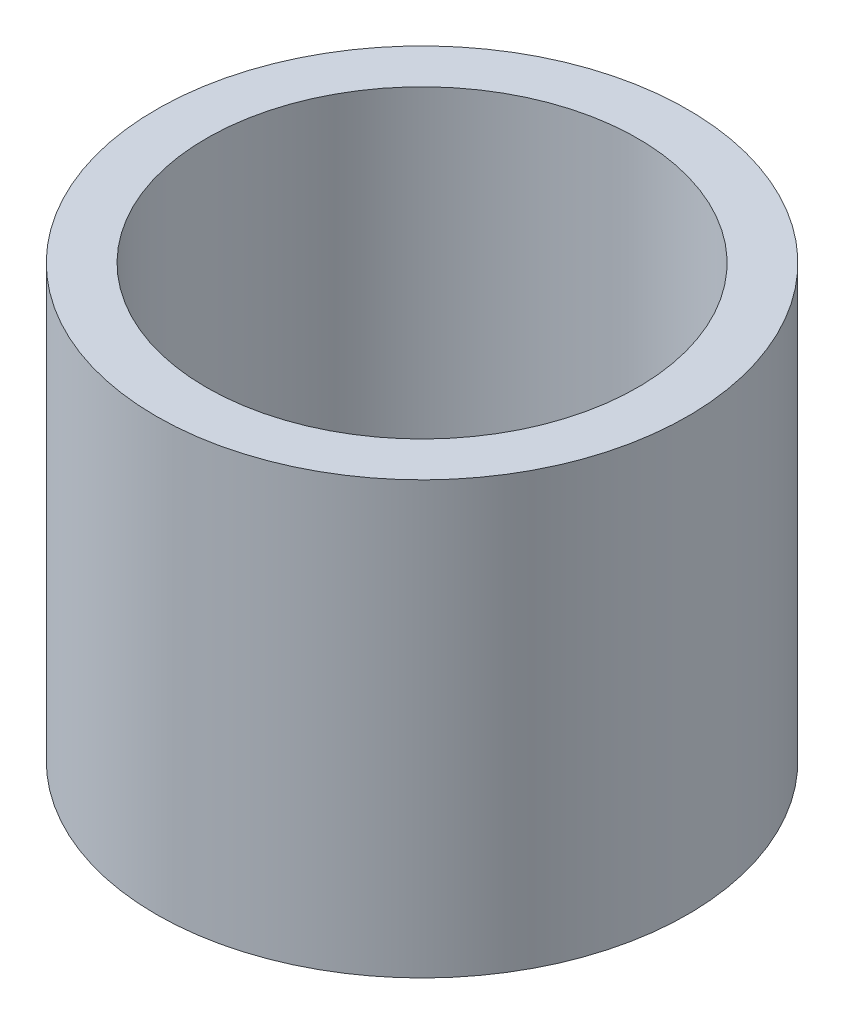
ISO-10303-21;
HEADER;
FILE_DESCRIPTION(('STEP AP214'),'2;1');
FILE_NAME('part.step','',(''),(''),'','','');
FILE_SCHEMA(('AUTOMOTIVE_DESIGN { 1 0 10303 214 1 1 1 1 }'));
ENDSEC;
DATA;
#1=APPLICATION_CONTEXT('core data for automotive mechanical design processes');
#2=APPLICATION_PROTOCOL_DEFINITION('international standard','automotive_design',2000,#1);
#3=PRODUCT_CONTEXT('',#1,'mechanical');
#4=PRODUCT('Part','Part','',(#3));
#5=PRODUCT_RELATED_PRODUCT_CATEGORY('part','',(#4));
#6=PRODUCT_DEFINITION_FORMATION('','',#4);
#7=PRODUCT_DEFINITION_CONTEXT('part definition',#1,'design');
#8=PRODUCT_DEFINITION('design','',#6,#7);
#9=PRODUCT_DEFINITION_SHAPE('','',#8);
#10=(LENGTH_UNIT() NAMED_UNIT(*) SI_UNIT(.MILLI.,.METRE.));
#11=(NAMED_UNIT(*) PLANE_ANGLE_UNIT() SI_UNIT($,.RADIAN.));
#12=(NAMED_UNIT(*) SI_UNIT($,.STERADIAN.) SOLID_ANGLE_UNIT());
#13=UNCERTAINTY_MEASURE_WITH_UNIT(LENGTH_MEASURE(1.E-05),#10,'distance_accuracy_value','');
#14=(GEOMETRIC_REPRESENTATION_CONTEXT(3) GLOBAL_UNCERTAINTY_ASSIGNED_CONTEXT((#13)) GLOBAL_UNIT_ASSIGNED_CONTEXT((#10,
#11,#12)) REPRESENTATION_CONTEXT('',''));
#15=CARTESIAN_POINT('',(0.,0.,0.));
#16=DIRECTION('',(0.,0.,1.));
#17=DIRECTION('',(1.,0.,0.));
#18=AXIS2_PLACEMENT_3D('',#15,#16,#17);
#19=CARTESIAN_POINT('',(0.,1.8357748217994,0.));
#20=DIRECTION('',(0.,1.,0.));
#21=DIRECTION('',(0.,0.,1.));
#22=AXIS2_PLACEMENT_3D('',#19,#20,#21);
#23=CYLINDRICAL_SURFACE('',#22,1.54);
#24=CARTESIAN_POINT('',(0.,2.5,0.));
#25=DIRECTION('',(0.,1.,0.));
#26=DIRECTION('',(0.,0.,1.));
#27=AXIS2_PLACEMENT_3D('',#24,#25,#26);
#28=CIRCLE('',#27,1.54);
#29=CARTESIAN_POINT('',(0.,2.5,1.54));
#30=VERTEX_POINT('',#29);
#31=EDGE_CURVE('E45',#30,#30,#28,.T.);
#32=ORIENTED_EDGE('',*,*,#31,.F.);
#33=EDGE_LOOP('',(#32));
#34=FACE_BOUND('',#33,.T.);
#35=CARTESIAN_POINT('',(0.,0.,0.));
#36=DIRECTION('',(0.,1.,0.));
#37=DIRECTION('',(0.,0.,1.));
#38=AXIS2_PLACEMENT_3D('',#35,#36,#37);
#39=CIRCLE('',#38,1.54);
#40=CARTESIAN_POINT('',(0.,0.,1.54));
#41=VERTEX_POINT('',#40);
#42=EDGE_CURVE('E10',#41,#41,#39,.T.);
#43=ORIENTED_EDGE('',*,*,#42,.T.);
#44=EDGE_LOOP('',(#43));
#45=FACE_BOUND('',#44,.T.);
#46=ADVANCED_FACE('F31',(#34,#45),#23,.T.);
#47=CARTESIAN_POINT('',(1.54,0.,0.));
#48=DIRECTION('',(0.,1.,0.));
#49=DIRECTION('',(0.,0.,1.));
#50=AXIS2_PLACEMENT_3D('',#47,#48,#49);
#51=PLANE('',#50);
#52=ORIENTED_EDGE('',*,*,#42,.F.);
#53=EDGE_LOOP('',(#52));
#54=FACE_BOUND('',#53,.T.);
#55=CARTESIAN_POINT('',(0.,0.,0.));
#56=DIRECTION('',(0.,1.,0.));
#57=DIRECTION('',(0.,0.,1.));
#58=AXIS2_PLACEMENT_3D('',#55,#56,#57);
#59=CIRCLE('',#58,1.25);
#60=CARTESIAN_POINT('',(0.,0.,1.25));
#61=VERTEX_POINT('',#60);
#62=EDGE_CURVE('E37',#61,#61,#59,.T.);
#63=ORIENTED_EDGE('',*,*,#62,.T.);
#64=EDGE_LOOP('',(#63));
#65=FACE_BOUND('',#64,.T.);
#66=ADVANCED_FACE('F54',(#54,#65),#51,.F.);
#67=CARTESIAN_POINT('',(0.,1.8357748217994,0.));
#68=DIRECTION('',(0.,1.,0.));
#69=DIRECTION('',(0.,0.,1.));
#70=AXIS2_PLACEMENT_3D('',#67,#68,#69);
#71=CYLINDRICAL_SURFACE('',#70,1.25);
#72=ORIENTED_EDGE('',*,*,#62,.F.);
#73=EDGE_LOOP('',(#72));
#74=FACE_BOUND('',#73,.T.);
#75=CARTESIAN_POINT('',(0.,2.5,0.));
#76=DIRECTION('',(0.,1.,0.));
#77=DIRECTION('',(0.,0.,1.));
#78=AXIS2_PLACEMENT_3D('',#75,#76,#77);
#79=CIRCLE('',#78,1.25);
#80=CARTESIAN_POINT('',(0.,2.5,1.25));
#81=VERTEX_POINT('',#80);
#82=EDGE_CURVE('E41',#81,#81,#79,.T.);
#83=ORIENTED_EDGE('',*,*,#82,.T.);
#84=EDGE_LOOP('',(#83));
#85=FACE_BOUND('',#84,.T.);
#86=ADVANCED_FACE('F58',(#74,#85),#71,.F.);
#87=CARTESIAN_POINT('',(1.25,2.5,0.));
#88=DIRECTION('',(0.,-1.,0.));
#89=DIRECTION('',(0.,0.,-1.));
#90=AXIS2_PLACEMENT_3D('',#87,#88,#89);
#91=PLANE('',#90);
#92=ORIENTED_EDGE('',*,*,#82,.F.);
#93=EDGE_LOOP('',(#92));
#94=FACE_BOUND('',#93,.T.);
#95=ORIENTED_EDGE('',*,*,#31,.T.);
#96=EDGE_LOOP('',(#95));
#97=FACE_BOUND('',#96,.T.);
#98=ADVANCED_FACE('F51',(#94,#97),#91,.F.);
#99=CLOSED_SHELL('',(#46,#66,#86,#98));
#100=MANIFOLD_SOLID_BREP('B2',#99);
#101=ADVANCED_BREP_SHAPE_REPRESENTATION('',(#18,#100),#14);
#102=SHAPE_DEFINITION_REPRESENTATION(#9,#101);
ENDSEC;
END-ISO-10303-21;
